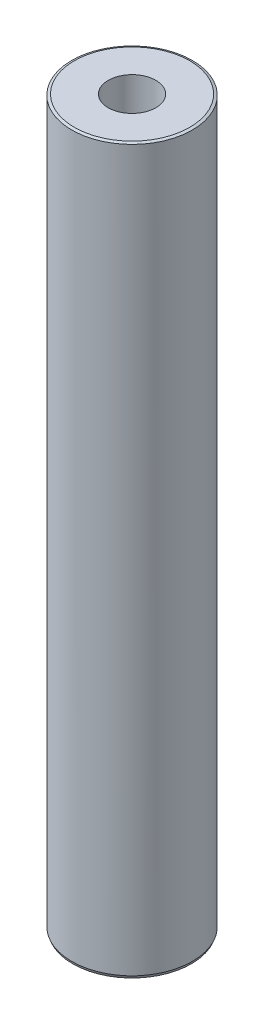
ISO-10303-21;
HEADER;
FILE_DESCRIPTION(('STEP AP214'),'2;1');
FILE_NAME('part.step','',(''),(''),'','','');
FILE_SCHEMA(('AUTOMOTIVE_DESIGN { 1 0 10303 214 1 1 1 1 }'));
ENDSEC;
DATA;
#1=APPLICATION_CONTEXT('core data for automotive mechanical design processes');
#2=APPLICATION_PROTOCOL_DEFINITION('international standard','automotive_design',2000,#1);
#3=PRODUCT_CONTEXT('',#1,'mechanical');
#4=PRODUCT('Part','Part','',(#3));
#5=PRODUCT_RELATED_PRODUCT_CATEGORY('part','',(#4));
#6=PRODUCT_DEFINITION_FORMATION('','',#4);
#7=PRODUCT_DEFINITION_CONTEXT('part definition',#1,'design');
#8=PRODUCT_DEFINITION('design','',#6,#7);
#9=PRODUCT_DEFINITION_SHAPE('','',#8);
#10=(LENGTH_UNIT() NAMED_UNIT(*) SI_UNIT(.MILLI.,.METRE.));
#11=(NAMED_UNIT(*) PLANE_ANGLE_UNIT() SI_UNIT($,.RADIAN.));
#12=(NAMED_UNIT(*) SI_UNIT($,.STERADIAN.) SOLID_ANGLE_UNIT());
#13=UNCERTAINTY_MEASURE_WITH_UNIT(LENGTH_MEASURE(1.E-05),#10,'distance_accuracy_value','');
#14=(GEOMETRIC_REPRESENTATION_CONTEXT(3) GLOBAL_UNCERTAINTY_ASSIGNED_CONTEXT((#13)) GLOBAL_UNIT_ASSIGNED_CONTEXT((#10,
#11,#12)) REPRESENTATION_CONTEXT('',''));
#15=CARTESIAN_POINT('',(0.,0.,0.));
#16=DIRECTION('',(0.,0.,1.));
#17=DIRECTION('',(1.,0.,0.));
#18=AXIS2_PLACEMENT_3D('',#15,#16,#17);
#19=CARTESIAN_POINT('',(0.,600.,0.));
#20=DIRECTION('',(0.,-1.,0.));
#21=DIRECTION('',(0.,0.,-1.));
#22=AXIS2_PLACEMENT_3D('',#19,#20,#21);
#23=CYLINDRICAL_SURFACE('',#22,50.);
#24=CARTESIAN_POINT('',(0.,599.177517872684,0.));
#25=DIRECTION('',(0.,1.,0.));
#26=DIRECTION('',(0.,0.,1.));
#27=AXIS2_PLACEMENT_3D('',#24,#25,#26);
#28=CIRCLE('',#27,50.);
#29=CARTESIAN_POINT('',(0.,599.177517872684,-50.0000000000001));
#30=VERTEX_POINT('',#29);
#31=EDGE_CURVE('E50',#30,#30,#28,.F.);
#32=ORIENTED_EDGE('',*,*,#31,.T.);
#33=EDGE_LOOP('',(#32));
#34=FACE_BOUND('',#33,.T.);
#35=CARTESIAN_POINT('',(0.,2.14993244395456,0.));
#36=DIRECTION('',(0.,1.,0.));
#37=DIRECTION('',(0.,0.,1.));
#38=AXIS2_PLACEMENT_3D('',#35,#36,#37);
#39=CIRCLE('',#38,50.);
#40=CARTESIAN_POINT('',(0.,2.14993244395456,50.));
#41=VERTEX_POINT('',#40);
#42=EDGE_CURVE('E51',#41,#41,#39,.T.);
#43=ORIENTED_EDGE('',*,*,#42,.T.);
#44=EDGE_LOOP('',(#43));
#45=FACE_BOUND('',#44,.T.);
#46=ADVANCED_FACE('F39',(#34,#45),#23,.T.);
#47=CARTESIAN_POINT('',(0.,600.,0.));
#48=DIRECTION('',(0.,1.,0.));
#49=DIRECTION('',(0.,0.,1.));
#50=AXIS2_PLACEMENT_3D('',#47,#48,#49);
#51=PLANE('',#50);
#52=CARTESIAN_POINT('',(0.,600.,0.));
#53=DIRECTION('',(0.,1.,0.));
#54=DIRECTION('',(0.,0.,1.));
#55=AXIS2_PLACEMENT_3D('',#52,#53,#54);
#56=CIRCLE('',#55,47.8500675560453);
#57=CARTESIAN_POINT('',(0.,600.,-47.8500675560454));
#58=VERTEX_POINT('',#57);
#59=EDGE_CURVE('E54',#58,#58,#56,.T.);
#60=ORIENTED_EDGE('',*,*,#59,.T.);
#61=EDGE_LOOP('',(#60));
#62=FACE_BOUND('',#61,.T.);
#63=CARTESIAN_POINT('',(0.,600.,0.));
#64=DIRECTION('',(0.,1.,0.));
#65=DIRECTION('',(0.,0.,1.));
#66=AXIS2_PLACEMENT_3D('',#63,#64,#65);
#67=CIRCLE('',#66,19.731622432637);
#68=CARTESIAN_POINT('',(0.,600.,19.731622432637));
#69=VERTEX_POINT('',#68);
#70=EDGE_CURVE('E58',#69,#69,#67,.T.);
#71=ORIENTED_EDGE('',*,*,#70,.F.);
#72=EDGE_LOOP('',(#71));
#73=FACE_BOUND('',#72,.T.);
#74=ADVANCED_FACE('F69',(#62,#73),#51,.T.);
#75=CARTESIAN_POINT('',(0.,0.,0.));
#76=DIRECTION('',(0.,1.,0.));
#77=DIRECTION('',(0.,0.,1.));
#78=AXIS2_PLACEMENT_3D('',#75,#76,#77);
#79=PLANE('',#78);
#80=CARTESIAN_POINT('',(0.,0.,0.));
#81=DIRECTION('',(0.,1.,0.));
#82=DIRECTION('',(0.,0.,1.));
#83=AXIS2_PLACEMENT_3D('',#80,#81,#82);
#84=CIRCLE('',#83,49.1775178726845);
#85=CARTESIAN_POINT('',(0.,0.,49.1775178726845));
#86=VERTEX_POINT('',#85);
#87=EDGE_CURVE('E10',#86,#86,#84,.F.);
#88=ORIENTED_EDGE('',*,*,#87,.T.);
#89=EDGE_LOOP('',(#88));
#90=FACE_BOUND('',#89,.T.);
#91=CARTESIAN_POINT('',(0.,0.,0.));
#92=DIRECTION('',(0.,1.,0.));
#93=DIRECTION('',(0.,0.,1.));
#94=AXIS2_PLACEMENT_3D('',#91,#92,#93);
#95=CIRCLE('',#94,19.731622432637);
#96=CARTESIAN_POINT('',(0.,0.,19.731622432637));
#97=VERTEX_POINT('',#96);
#98=EDGE_CURVE('E63',#97,#97,#95,.T.);
#99=ORIENTED_EDGE('',*,*,#98,.T.);
#100=EDGE_LOOP('',(#99));
#101=FACE_BOUND('',#100,.T.);
#102=ADVANCED_FACE('F75',(#90,#101),#79,.F.);
#103=CARTESIAN_POINT('',(0.,600.,0.));
#104=DIRECTION('',(0.,-1.,0.));
#105=DIRECTION('',(0.,0.,-1.));
#106=AXIS2_PLACEMENT_3D('',#103,#104,#105);
#107=CYLINDRICAL_SURFACE('',#106,19.731622432637);
#108=ORIENTED_EDGE('',*,*,#70,.T.);
#109=EDGE_LOOP('',(#108));
#110=FACE_BOUND('',#109,.T.);
#111=ORIENTED_EDGE('',*,*,#98,.F.);
#112=EDGE_LOOP('',(#111));
#113=FACE_BOUND('',#112,.T.);
#114=ADVANCED_FACE('F70',(#110,#113),#107,.F.);
#115=CARTESIAN_POINT('',(0.,600.,0.));
#116=DIRECTION('',(0.,-1.,0.));
#117=DIRECTION('',(0.,0.,-1.));
#118=AXIS2_PLACEMENT_3D('',#115,#116,#117);
#119=CONICAL_SURFACE('',#118,47.8500675560453,1.20541262897616);
#120=CARTESIAN_POINT('',(0.,599.177517872684,-50.0000000000001));
#121=CARTESIAN_POINT('',(0.,599.186085394844,-49.9776048703756));
#122=CARTESIAN_POINT('',(0.,599.194652917004,-49.9552097407511));
#123=CARTESIAN_POINT('',(0.,599.211787961322,-49.910419481502));
#124=CARTESIAN_POINT('',(0.,599.220355483482,-49.8880243518775));
#125=CARTESIAN_POINT('',(0.,599.237490527801,-49.8432340926284));
#126=CARTESIAN_POINT('',(0.,599.246058049961,-49.8208389630039));
#127=CARTESIAN_POINT('',(0.,599.26319309428,-49.7760487037549));
#128=CARTESIAN_POINT('',(0.,599.271760616439,-49.7536535741303));
#129=CARTESIAN_POINT('',(0.,599.288895660758,-49.7088633148813));
#130=CARTESIAN_POINT('',(0.,599.297463182918,-49.6864681852567));
#131=CARTESIAN_POINT('',(0.,599.314598227237,-49.6416779260077));
#132=CARTESIAN_POINT('',(0.,599.323165749396,-49.6192827963832));
#133=CARTESIAN_POINT('',(0.,599.340300793716,-49.5744925371341));
#134=CARTESIAN_POINT('',(0.,599.348868315875,-49.5520974075096));
#135=CARTESIAN_POINT('',(0.,599.366003360194,-49.5073071482605));
#136=CARTESIAN_POINT('',(0.,599.374570882354,-49.484912018636));
#137=CARTESIAN_POINT('',(0.,599.391705926673,-49.4401217593869));
#138=CARTESIAN_POINT('',(0.,599.400273448832,-49.4177266297624));
#139=CARTESIAN_POINT('',(0.,599.417408493151,-49.3729363705134));
#140=CARTESIAN_POINT('',(0.,599.425976015311,-49.3505412408888));
#141=CARTESIAN_POINT('',(0.,599.44311105963,-49.3057509816398));
#142=CARTESIAN_POINT('',(0.,599.451678581789,-49.2833558520152));
#143=CARTESIAN_POINT('',(0.,599.468813626109,-49.2385655927662));
#144=CARTESIAN_POINT('',(0.,599.477381148268,-49.2161704631417));
#145=CARTESIAN_POINT('',(0.,599.494516192587,-49.1713802038926));
#146=CARTESIAN_POINT('',(0.,599.503083714747,-49.1489850742681));
#147=CARTESIAN_POINT('',(0.,599.520218759066,-49.104194815019));
#148=CARTESIAN_POINT('',(0.,599.528786281225,-49.0817996853945));
#149=CARTESIAN_POINT('',(0.,599.545921325544,-49.0370094261454));
#150=CARTESIAN_POINT('',(0.,599.554488847704,-49.0146142965209));
#151=CARTESIAN_POINT('',(0.,599.571623892023,-48.9698240372718));
#152=CARTESIAN_POINT('',(0.,599.580191414183,-48.9474289076473));
#153=CARTESIAN_POINT('',(0.,599.597326458502,-48.9026386483983));
#154=CARTESIAN_POINT('',(0.,599.605893980661,-48.8802435187737));
#155=CARTESIAN_POINT('',(0.,599.62302902498,-48.8354532595247));
#156=CARTESIAN_POINT('',(0.,599.63159654714,-48.8130581299001));
#157=CARTESIAN_POINT('',(0.,599.648731591459,-48.7682678706511));
#158=CARTESIAN_POINT('',(0.,599.657299113618,-48.7458727410265));
#159=CARTESIAN_POINT('',(0.,599.674434157937,-48.7010824817775));
#160=CARTESIAN_POINT('',(0.,599.683001680097,-48.678687352153));
#161=CARTESIAN_POINT('',(0.,599.700136724416,-48.6338970929039));
#162=CARTESIAN_POINT('',(0.,599.708704246576,-48.6115019632794));
#163=CARTESIAN_POINT('',(0.,599.725839290895,-48.5667117040303));
#164=CARTESIAN_POINT('',(0.,599.734406813054,-48.5443165744058));
#165=CARTESIAN_POINT('',(0.,599.751541857373,-48.4995263151567));
#166=CARTESIAN_POINT('',(0.,599.760109379533,-48.4771311855322));
#167=CARTESIAN_POINT('',(0.,599.777244423852,-48.4323409262831));
#168=CARTESIAN_POINT('',(0.,599.785811946012,-48.4099457966586));
#169=CARTESIAN_POINT('',(0.,599.80294699033,-48.3651555374096));
#170=CARTESIAN_POINT('',(0.,599.81151451249,-48.342760407785));
#171=CARTESIAN_POINT('',(0.,599.828649556809,-48.297970148536));
#172=CARTESIAN_POINT('',(0.,599.837217078969,-48.2755750189114));
#173=CARTESIAN_POINT('',(0.,599.854352123288,-48.2307847596624));
#174=CARTESIAN_POINT('',(0.,599.862919645447,-48.2083896300379));
#175=CARTESIAN_POINT('',(0.,599.880054689766,-48.1635993707888));
#176=CARTESIAN_POINT('',(0.,599.888622211926,-48.1412042411643));
#177=CARTESIAN_POINT('',(0.,599.905757256245,-48.0964139819152));
#178=CARTESIAN_POINT('',(0.,599.914324778405,-48.0740188522907));
#179=CARTESIAN_POINT('',(0.,599.931459822724,-48.0292285930416));
#180=CARTESIAN_POINT('',(0.,599.940027344883,-48.0068334634171));
#181=CARTESIAN_POINT('',(0.,599.957162389202,-47.9620432041681));
#182=CARTESIAN_POINT('',(0.,599.965729911362,-47.9396480745435));
#183=CARTESIAN_POINT('',(0.,599.982864955681,-47.8948578152945));
#184=CARTESIAN_POINT('',(0.,599.99143247784,-47.8724626856699));
#185=CARTESIAN_POINT('',(0.,600.,-47.8500675560454));
#186=B_SPLINE_CURVE_WITH_KNOTS('',3,(#120,#121,#122,#123,#124,#125,#126,#127,#128,#129,#130,
#131,#132,#133,#134,#135,#136,#137,#138,#139,#140,#141,#142,#143,#144,#145,#146,#147,#148,#149,
#150,#151,#152,#153,#154,#155,#156,#157,#158,#159,#160,#161,#162,#163,#164,#165,#166,#167,#168,
#169,#170,#171,#172,#173,#174,#175,#176,#177,#178,#179,#180,#181,#182,#183,#184,#185),
.UNSPECIFIED.,.F.,.F.,(4,2,2,2,2,2,2,2,2,2,2,2,2,2,2,2,2,2,2,2,2,2,2,2,2,2,2,2,2,2,2,2,4),(0.,
0.0719339864159309,0.143867972831829,0.21580195924772,0.287735945663611,0.359669932079509,
0.4316039184954,0.503537904911291,0.575471891327189,0.64740587774308,0.719339864158971,
0.791273850574902,0.8632078369908,0.935141823406691,1.00707580982258,1.07900979623848,
1.15094378265437,1.22287776907026,1.29481175548616,1.36674574190205,1.43867972831794,
1.51061371473384,1.58254770114977,1.65448168756566,1.72641567398156,1.79834966039745,
1.87028364681334,1.94221763322924,2.01415161964513,2.08608560606102,2.15801959247691,
2.22995357889281,2.30188756530874),.UNSPECIFIED.);
#187=EDGE_CURVE('BSEAM81',#30,#58,#186,.T.);
#188=ORIENTED_EDGE('',*,*,#31,.F.);
#189=ORIENTED_EDGE('',*,*,#59,.F.);
#190=ORIENTED_EDGE('',*,*,#187,.T.);
#191=ORIENTED_EDGE('',*,*,#187,.F.);
#192=EDGE_LOOP('',(#188,#190,#189,#191));
#193=FACE_BOUND('',#192,.T.);
#194=ADVANCED_FACE('F81',(#193),#119,.T.);
#195=CARTESIAN_POINT('',(0.,2.14993244395456,0.));
#196=DIRECTION('',(0.,1.,0.));
#197=DIRECTION('',(0.,0.,1.));
#198=AXIS2_PLACEMENT_3D('',#195,#196,#197);
#199=CONICAL_SURFACE('',#198,50.,0.365383697818738);
#200=ORIENTED_EDGE('',*,*,#87,.F.);
#201=EDGE_LOOP('',(#200));
#202=FACE_BOUND('',#201,.T.);
#203=ORIENTED_EDGE('',*,*,#42,.F.);
#204=EDGE_LOOP('',(#203));
#205=FACE_BOUND('',#204,.T.);
#206=ADVANCED_FACE('F45',(#202,#205),#199,.T.);
#207=CLOSED_SHELL('',(#46,#74,#102,#114,#194,#206));
#208=MANIFOLD_SOLID_BREP('B2',#207);
#209=ADVANCED_BREP_SHAPE_REPRESENTATION('',(#18,#208),#14);
#210=SHAPE_DEFINITION_REPRESENTATION(#9,#209);
ENDSEC;
END-ISO-10303-21;
